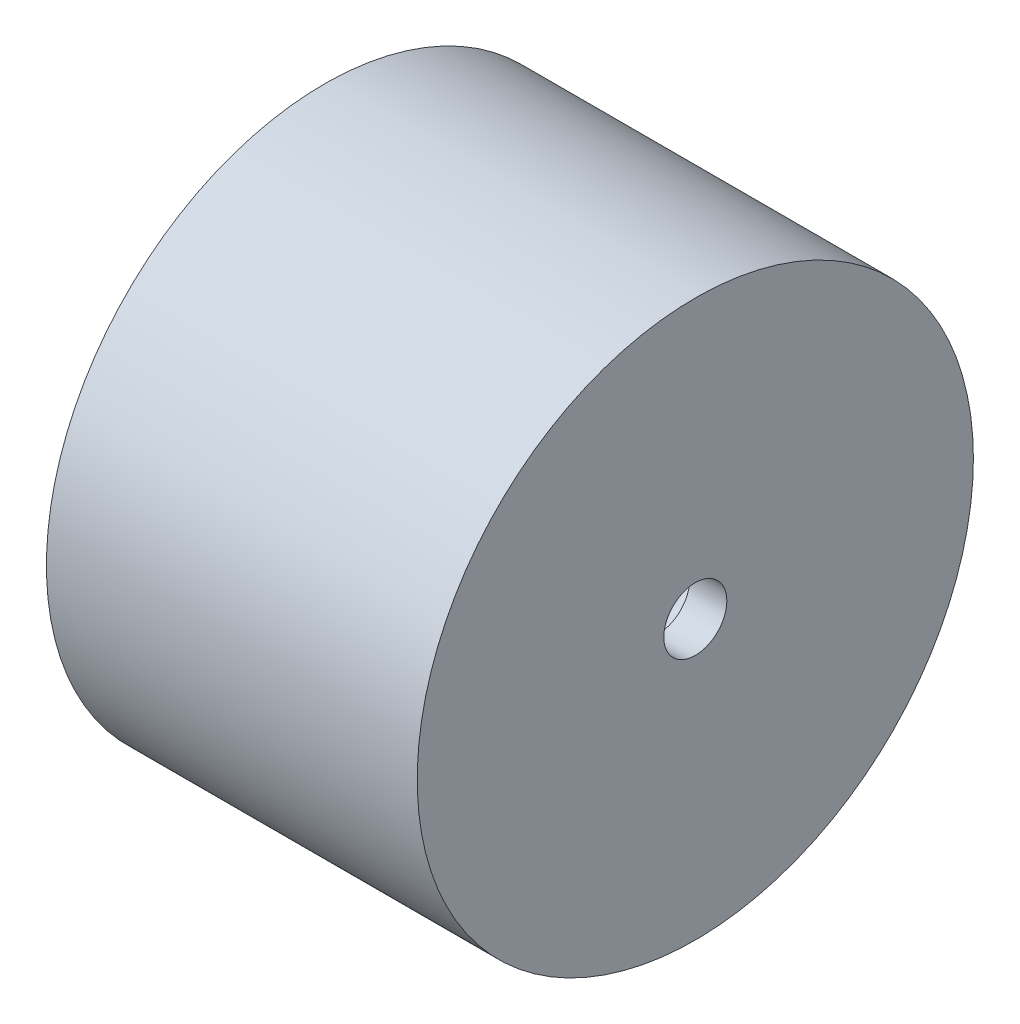
ISO-10303-21;
HEADER;
FILE_DESCRIPTION(('STEP AP214'),'2;1');
FILE_NAME('part.step','',(''),(''),'','','');
FILE_SCHEMA(('AUTOMOTIVE_DESIGN { 1 0 10303 214 1 1 1 1 }'));
ENDSEC;
DATA;
#1=APPLICATION_CONTEXT('core data for automotive mechanical design processes');
#2=APPLICATION_PROTOCOL_DEFINITION('international standard','automotive_design',2000,#1);
#3=PRODUCT_CONTEXT('',#1,'mechanical');
#4=PRODUCT('Part','Part','',(#3));
#5=PRODUCT_RELATED_PRODUCT_CATEGORY('part','',(#4));
#6=PRODUCT_DEFINITION_FORMATION('','',#4);
#7=PRODUCT_DEFINITION_CONTEXT('part definition',#1,'design');
#8=PRODUCT_DEFINITION('design','',#6,#7);
#9=PRODUCT_DEFINITION_SHAPE('','',#8);
#10=(LENGTH_UNIT() NAMED_UNIT(*) SI_UNIT(.MILLI.,.METRE.));
#11=(NAMED_UNIT(*) PLANE_ANGLE_UNIT() SI_UNIT($,.RADIAN.));
#12=(NAMED_UNIT(*) SI_UNIT($,.STERADIAN.) SOLID_ANGLE_UNIT());
#13=UNCERTAINTY_MEASURE_WITH_UNIT(LENGTH_MEASURE(1.E-05),#10,'distance_accuracy_value','');
#14=(GEOMETRIC_REPRESENTATION_CONTEXT(3) GLOBAL_UNCERTAINTY_ASSIGNED_CONTEXT((#13)) GLOBAL_UNIT_ASSIGNED_CONTEXT((#10,
#11,#12)) REPRESENTATION_CONTEXT('',''));
#15=CARTESIAN_POINT('',(0.,0.,0.));
#16=DIRECTION('',(0.,0.,1.));
#17=DIRECTION('',(1.,0.,0.));
#18=AXIS2_PLACEMENT_3D('',#15,#16,#17);
#19=CARTESIAN_POINT('',(20.,0.,0.));
#20=DIRECTION('',(-1.,0.,0.));
#21=DIRECTION('',(0.,0.,1.));
#22=AXIS2_PLACEMENT_3D('',#19,#20,#21);
#23=CYLINDRICAL_SURFACE('',#22,15.);
#24=CARTESIAN_POINT('',(20.,0.,0.));
#25=DIRECTION('',(1.,0.,0.));
#26=DIRECTION('',(0.,0.,-1.));
#27=AXIS2_PLACEMENT_3D('',#24,#25,#26);
#28=CIRCLE('',#27,15.);
#29=CARTESIAN_POINT('',(20.,0.,-15.));
#30=VERTEX_POINT('',#29);
#31=EDGE_CURVE('E10',#30,#30,#28,.T.);
#32=ORIENTED_EDGE('',*,*,#31,.F.);
#33=EDGE_LOOP('',(#32));
#34=FACE_BOUND('',#33,.T.);
#35=CARTESIAN_POINT('',(0.,0.,0.));
#36=DIRECTION('',(1.,0.,0.));
#37=DIRECTION('',(0.,0.,-1.));
#38=AXIS2_PLACEMENT_3D('',#35,#36,#37);
#39=CIRCLE('',#38,15.);
#40=CARTESIAN_POINT('',(0.,0.,-15.));
#41=VERTEX_POINT('',#40);
#42=EDGE_CURVE('E39',#41,#41,#39,.T.);
#43=ORIENTED_EDGE('',*,*,#42,.T.);
#44=EDGE_LOOP('',(#43));
#45=FACE_BOUND('',#44,.T.);
#46=ADVANCED_FACE('F36',(#34,#45),#23,.T.);
#47=CARTESIAN_POINT('',(20.,0.,0.));
#48=DIRECTION('',(1.,0.,0.));
#49=DIRECTION('',(0.,0.,-1.));
#50=AXIS2_PLACEMENT_3D('',#47,#48,#49);
#51=PLANE('',#50);
#52=CARTESIAN_POINT('',(20.,0.,0.));
#53=DIRECTION('',(1.,0.,0.));
#54=DIRECTION('',(0.,0.,-1.));
#55=AXIS2_PLACEMENT_3D('',#52,#53,#54);
#56=CIRCLE('',#55,1.7);
#57=CARTESIAN_POINT('',(20.,0.,-1.7));
#58=VERTEX_POINT('',#57);
#59=EDGE_CURVE('E54',#58,#58,#56,.T.);
#60=ORIENTED_EDGE('',*,*,#59,.F.);
#61=EDGE_LOOP('',(#60));
#62=FACE_BOUND('',#61,.T.);
#63=ORIENTED_EDGE('',*,*,#31,.T.);
#64=EDGE_LOOP('',(#63));
#65=FACE_BOUND('',#64,.T.);
#66=ADVANCED_FACE('F69',(#62,#65),#51,.T.);
#67=CARTESIAN_POINT('',(0.,0.,0.));
#68=DIRECTION('',(1.,0.,0.));
#69=DIRECTION('',(0.,0.,-1.));
#70=AXIS2_PLACEMENT_3D('',#67,#68,#69);
#71=PLANE('',#70);
#72=CARTESIAN_POINT('',(0.,0.,0.));
#73=DIRECTION('',(1.,0.,0.));
#74=DIRECTION('',(0.,0.,-1.));
#75=AXIS2_PLACEMENT_3D('',#72,#73,#74);
#76=CIRCLE('',#75,13.);
#77=CARTESIAN_POINT('',(0.,0.,-13.));
#78=VERTEX_POINT('',#77);
#79=EDGE_CURVE('E48',#78,#78,#76,.T.);
#80=ORIENTED_EDGE('',*,*,#79,.T.);
#81=EDGE_LOOP('',(#80));
#82=FACE_BOUND('',#81,.T.);
#83=ORIENTED_EDGE('',*,*,#42,.F.);
#84=EDGE_LOOP('',(#83));
#85=FACE_BOUND('',#84,.T.);
#86=ADVANCED_FACE('F71',(#82,#85),#71,.F.);
#87=CARTESIAN_POINT('',(20.,0.,0.));
#88=DIRECTION('',(-1.,0.,0.));
#89=DIRECTION('',(0.,0.,1.));
#90=AXIS2_PLACEMENT_3D('',#87,#88,#89);
#91=CYLINDRICAL_SURFACE('',#90,13.);
#92=CARTESIAN_POINT('',(18.,0.,0.));
#93=DIRECTION('',(1.,0.,0.));
#94=DIRECTION('',(0.,0.,-1.));
#95=AXIS2_PLACEMENT_3D('',#92,#93,#94);
#96=CIRCLE('',#95,13.);
#97=CARTESIAN_POINT('',(18.,0.,-13.));
#98=VERTEX_POINT('',#97);
#99=EDGE_CURVE('E46',#98,#98,#96,.T.);
#100=ORIENTED_EDGE('',*,*,#99,.T.);
#101=EDGE_LOOP('',(#100));
#102=FACE_BOUND('',#101,.T.);
#103=ORIENTED_EDGE('',*,*,#79,.F.);
#104=EDGE_LOOP('',(#103));
#105=FACE_BOUND('',#104,.T.);
#106=ADVANCED_FACE('F77',(#102,#105),#91,.F.);
#107=CARTESIAN_POINT('',(18.,0.,0.));
#108=DIRECTION('',(1.,0.,0.));
#109=DIRECTION('',(0.,0.,-1.));
#110=AXIS2_PLACEMENT_3D('',#107,#108,#109);
#111=PLANE('',#110);
#112=CARTESIAN_POINT('',(18.,0.,0.));
#113=DIRECTION('',(1.,0.,0.));
#114=DIRECTION('',(0.,0.,-1.));
#115=AXIS2_PLACEMENT_3D('',#112,#113,#114);
#116=CIRCLE('',#115,1.7);
#117=CARTESIAN_POINT('',(18.,0.,-1.7));
#118=VERTEX_POINT('',#117);
#119=EDGE_CURVE('E51',#118,#118,#116,.T.);
#120=ORIENTED_EDGE('',*,*,#119,.T.);
#121=EDGE_LOOP('',(#120));
#122=FACE_BOUND('',#121,.T.);
#123=ORIENTED_EDGE('',*,*,#99,.F.);
#124=EDGE_LOOP('',(#123));
#125=FACE_BOUND('',#124,.T.);
#126=ADVANCED_FACE('F60',(#122,#125),#111,.F.);
#127=CARTESIAN_POINT('',(18.,0.,0.));
#128=DIRECTION('',(1.,0.,0.));
#129=DIRECTION('',(0.,0.,-1.));
#130=AXIS2_PLACEMENT_3D('',#127,#128,#129);
#131=CYLINDRICAL_SURFACE('',#130,1.7);
#132=ORIENTED_EDGE('',*,*,#119,.F.);
#133=EDGE_LOOP('',(#132));
#134=FACE_BOUND('',#133,.T.);
#135=ORIENTED_EDGE('',*,*,#59,.T.);
#136=EDGE_LOOP('',(#135));
#137=FACE_BOUND('',#136,.T.);
#138=ADVANCED_FACE('F63',(#134,#137),#131,.F.);
#139=CLOSED_SHELL('',(#46,#66,#86,#106,#126,#138));
#140=MANIFOLD_SOLID_BREP('B2',#139);
#141=ADVANCED_BREP_SHAPE_REPRESENTATION('',(#18,#140),#14);
#142=SHAPE_DEFINITION_REPRESENTATION(#9,#141);
ENDSEC;
END-ISO-10303-21;
